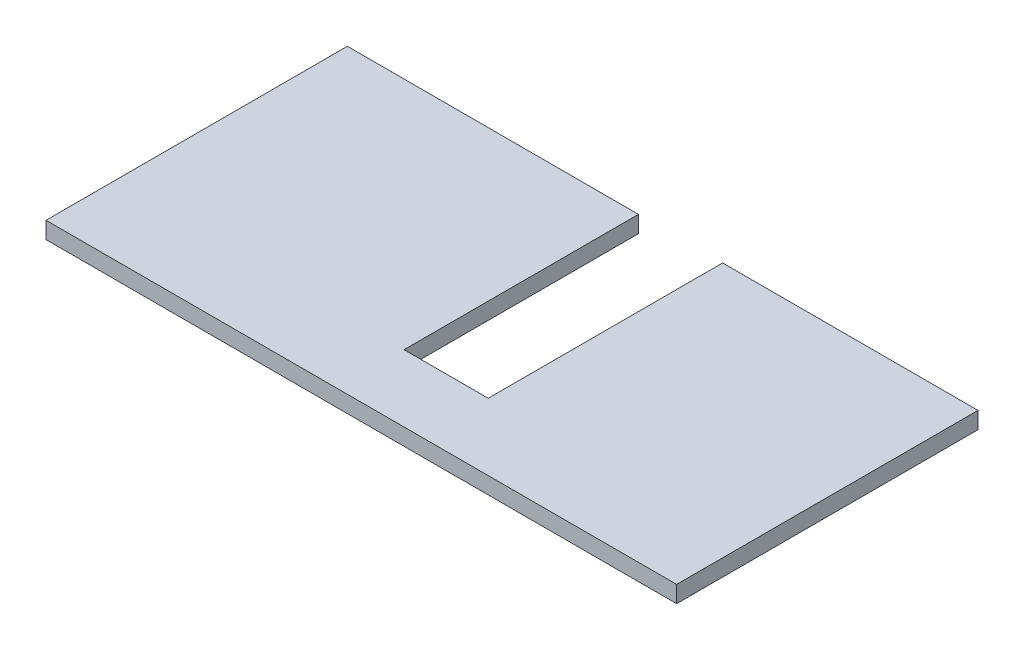
ISO-10303-21;
HEADER;
FILE_DESCRIPTION(('STEP AP214'),'2;1');
FILE_NAME('part.step','',(''),(''),'','','');
FILE_SCHEMA(('AUTOMOTIVE_DESIGN { 1 0 10303 214 1 1 1 1 }'));
ENDSEC;
DATA;
#1=APPLICATION_CONTEXT('core data for automotive mechanical design processes');
#2=APPLICATION_PROTOCOL_DEFINITION('international standard','automotive_design',2000,#1);
#3=PRODUCT_CONTEXT('',#1,'mechanical');
#4=PRODUCT('Part','Part','',(#3));
#5=PRODUCT_RELATED_PRODUCT_CATEGORY('part','',(#4));
#6=PRODUCT_DEFINITION_FORMATION('','',#4);
#7=PRODUCT_DEFINITION_CONTEXT('part definition',#1,'design');
#8=PRODUCT_DEFINITION('design','',#6,#7);
#9=PRODUCT_DEFINITION_SHAPE('','',#8);
#10=(LENGTH_UNIT() NAMED_UNIT(*) SI_UNIT(.MILLI.,.METRE.));
#11=(NAMED_UNIT(*) PLANE_ANGLE_UNIT() SI_UNIT($,.RADIAN.));
#12=(NAMED_UNIT(*) SI_UNIT($,.STERADIAN.) SOLID_ANGLE_UNIT());
#13=UNCERTAINTY_MEASURE_WITH_UNIT(LENGTH_MEASURE(1.E-05),#10,'distance_accuracy_value','');
#14=(GEOMETRIC_REPRESENTATION_CONTEXT(3) GLOBAL_UNCERTAINTY_ASSIGNED_CONTEXT((#13)) GLOBAL_UNIT_ASSIGNED_CONTEXT((#10,
#11,#12)) REPRESENTATION_CONTEXT('',''));
#15=CARTESIAN_POINT('',(0.,0.,0.));
#16=DIRECTION('',(0.,0.,1.));
#17=DIRECTION('',(1.,0.,0.));
#18=AXIS2_PLACEMENT_3D('',#15,#16,#17);
#19=CARTESIAN_POINT('',(0.,0.,0.));
#20=DIRECTION('',(0.,0.,-1.));
#21=DIRECTION('',(-1.,0.,0.));
#22=AXIS2_PLACEMENT_3D('',#19,#20,#21);
#23=PLANE('',#22);
#24=DIRECTION('',(0.,1.,0.));
#25=VECTOR('',#24,1.);
#26=CARTESIAN_POINT('',(3362.,0.,0.));
#27=LINE('',#26,#25);
#28=CARTESIAN_POINT('',(3362.,0.,0.));
#29=VERTEX_POINT('',#28);
#30=CARTESIAN_POINT('',(3362.,150.,0.));
#31=VERTEX_POINT('',#30);
#32=EDGE_CURVE('E113',#29,#31,#27,.T.);
#33=ORIENTED_EDGE('',*,*,#32,.T.);
#34=DIRECTION('',(-1.,0.,0.));
#35=VECTOR('',#34,1.);
#36=CARTESIAN_POINT('',(0.,150.,0.));
#37=LINE('',#36,#35);
#38=CARTESIAN_POINT('',(5650.,150.,0.));
#39=VERTEX_POINT('',#38);
#40=EDGE_CURVE('E151',#39,#31,#37,.T.);
#41=ORIENTED_EDGE('',*,*,#40,.F.);
#42=DIRECTION('',(0.,1.,0.));
#43=VECTOR('',#42,1.);
#44=CARTESIAN_POINT('',(5650.,0.,0.));
#45=LINE('',#44,#43);
#46=CARTESIAN_POINT('',(5650.,0.,0.));
#47=VERTEX_POINT('',#46);
#48=EDGE_CURVE('E136',#47,#39,#45,.T.);
#49=ORIENTED_EDGE('',*,*,#48,.F.);
#50=DIRECTION('',(1.,0.,0.));
#51=VECTOR('',#50,1.);
#52=CARTESIAN_POINT('',(0.,0.,0.));
#53=LINE('',#52,#51);
#54=EDGE_CURVE('E129',#29,#47,#53,.T.);
#55=ORIENTED_EDGE('',*,*,#54,.F.);
#56=EDGE_LOOP('',(#33,#41,#49,#55));
#57=FACE_BOUND('',#56,.T.);
#58=ADVANCED_FACE('F38',(#57),#23,.T.);
#59=CARTESIAN_POINT('',(0.,0.,2700.));
#60=DIRECTION('',(1.,0.,0.));
#61=DIRECTION('',(0.,0.,-1.));
#62=AXIS2_PLACEMENT_3D('',#59,#60,#61);
#63=PLANE('',#62);
#64=DIRECTION('',(0.,-1.,0.));
#65=VECTOR('',#64,1.);
#66=CARTESIAN_POINT('',(0.,0.,0.));
#67=LINE('',#66,#65);
#68=CARTESIAN_POINT('',(0.,150.,0.));
#69=VERTEX_POINT('',#68);
#70=CARTESIAN_POINT('',(0.,0.,0.));
#71=VERTEX_POINT('',#70);
#72=EDGE_CURVE('E139',#69,#71,#67,.T.);
#73=ORIENTED_EDGE('',*,*,#72,.T.);
#74=DIRECTION('',(0.,0.,-1.));
#75=VECTOR('',#74,1.);
#76=CARTESIAN_POINT('',(0.,0.,2700.));
#77=LINE('',#76,#75);
#78=CARTESIAN_POINT('',(0.,0.,2700.));
#79=VERTEX_POINT('',#78);
#80=EDGE_CURVE('E11',#79,#71,#77,.T.);
#81=ORIENTED_EDGE('',*,*,#80,.F.);
#82=DIRECTION('',(0.,-1.,0.));
#83=VECTOR('',#82,1.);
#84=CARTESIAN_POINT('',(0.,0.,2700.));
#85=LINE('',#84,#83);
#86=CARTESIAN_POINT('',(0.,150.,2700.));
#87=VERTEX_POINT('',#86);
#88=EDGE_CURVE('E154',#87,#79,#85,.T.);
#89=ORIENTED_EDGE('',*,*,#88,.F.);
#90=DIRECTION('',(0.,0.,-1.));
#91=VECTOR('',#90,1.);
#92=CARTESIAN_POINT('',(0.,150.,2700.));
#93=LINE('',#92,#91);
#94=EDGE_CURVE('E155',#87,#69,#93,.T.);
#95=ORIENTED_EDGE('',*,*,#94,.T.);
#96=EDGE_LOOP('',(#73,#81,#89,#95));
#97=FACE_BOUND('',#96,.T.);
#98=ADVANCED_FACE('F40',(#97),#63,.F.);
#99=CARTESIAN_POINT('',(0.,0.,2700.));
#100=DIRECTION('',(0.,1.,0.));
#101=DIRECTION('',(0.,0.,1.));
#102=AXIS2_PLACEMENT_3D('',#99,#100,#101);
#103=PLANE('',#102);
#104=DIRECTION('',(1.,0.,0.));
#105=VECTOR('',#104,1.);
#106=CARTESIAN_POINT('',(3362.,0.,2100.));
#107=LINE('',#106,#105);
#108=CARTESIAN_POINT('',(2608.,0.,2100.));
#109=VERTEX_POINT('',#108);
#110=CARTESIAN_POINT('',(3362.,0.,2100.));
#111=VERTEX_POINT('',#110);
#112=EDGE_CURVE('E126',#109,#111,#107,.T.);
#113=ORIENTED_EDGE('',*,*,#112,.T.);
#114=DIRECTION('',(0.,0.,-1.));
#115=VECTOR('',#114,1.);
#116=CARTESIAN_POINT('',(3362.,0.,0.));
#117=LINE('',#116,#115);
#118=EDGE_CURVE('E116',#111,#29,#117,.T.);
#119=ORIENTED_EDGE('',*,*,#118,.T.);
#120=ORIENTED_EDGE('',*,*,#54,.T.);
#121=DIRECTION('',(0.,0.,-1.));
#122=VECTOR('',#121,1.);
#123=CARTESIAN_POINT('',(5650.,0.,2700.));
#124=LINE('',#123,#122);
#125=CARTESIAN_POINT('',(5650.,0.,2700.));
#126=VERTEX_POINT('',#125);
#127=EDGE_CURVE('E47',#126,#47,#124,.T.);
#128=ORIENTED_EDGE('',*,*,#127,.F.);
#129=DIRECTION('',(1.,0.,0.));
#130=VECTOR('',#129,1.);
#131=CARTESIAN_POINT('',(0.,0.,2700.));
#132=LINE('',#131,#130);
#133=EDGE_CURVE('E91',#79,#126,#132,.T.);
#134=ORIENTED_EDGE('',*,*,#133,.F.);
#135=ORIENTED_EDGE('',*,*,#80,.T.);
#136=CARTESIAN_POINT('',(2608.,0.,0.));
#137=VERTEX_POINT('',#136);
#138=EDGE_CURVE('E138',#71,#137,#53,.T.);
#139=ORIENTED_EDGE('',*,*,#138,.T.);
#140=DIRECTION('',(0.,0.,1.));
#141=VECTOR('',#140,1.);
#142=CARTESIAN_POINT('',(2608.,0.,0.));
#143=LINE('',#142,#141);
#144=EDGE_CURVE('E54',#137,#109,#143,.T.);
#145=ORIENTED_EDGE('',*,*,#144,.T.);
#146=EDGE_LOOP('',(#113,#119,#120,#128,#134,#135,#139,#145));
#147=FACE_BOUND('',#146,.T.);
#148=ADVANCED_FACE('F128',(#147),#103,.F.);
#149=CARTESIAN_POINT('',(5650.,0.,2700.));
#150=DIRECTION('',(-1.,0.,0.));
#151=DIRECTION('',(0.,0.,1.));
#152=AXIS2_PLACEMENT_3D('',#149,#150,#151);
#153=PLANE('',#152);
#154=ORIENTED_EDGE('',*,*,#48,.T.);
#155=DIRECTION('',(0.,0.,-1.));
#156=VECTOR('',#155,1.);
#157=CARTESIAN_POINT('',(5650.,150.,2700.));
#158=LINE('',#157,#156);
#159=CARTESIAN_POINT('',(5650.,150.,2700.));
#160=VERTEX_POINT('',#159);
#161=EDGE_CURVE('E158',#160,#39,#158,.T.);
#162=ORIENTED_EDGE('',*,*,#161,.F.);
#163=DIRECTION('',(0.,1.,0.));
#164=VECTOR('',#163,1.);
#165=CARTESIAN_POINT('',(5650.,0.,2700.));
#166=LINE('',#165,#164);
#167=EDGE_CURVE('E166',#126,#160,#166,.T.);
#168=ORIENTED_EDGE('',*,*,#167,.F.);
#169=ORIENTED_EDGE('',*,*,#127,.T.);
#170=EDGE_LOOP('',(#154,#162,#168,#169));
#171=FACE_BOUND('',#170,.T.);
#172=ADVANCED_FACE('F164',(#171),#153,.F.);
#173=CARTESIAN_POINT('',(0.,150.,2700.));
#174=DIRECTION('',(0.,-1.,0.));
#175=DIRECTION('',(1.,0.,0.));
#176=AXIS2_PLACEMENT_3D('',#173,#174,#175);
#177=PLANE('',#176);
#178=ORIENTED_EDGE('',*,*,#40,.T.);
#179=DIRECTION('',(0.,0.,-1.));
#180=VECTOR('',#179,1.);
#181=CARTESIAN_POINT('',(3362.,150.,0.));
#182=LINE('',#181,#180);
#183=CARTESIAN_POINT('',(3362.,150.,2100.));
#184=VERTEX_POINT('',#183);
#185=EDGE_CURVE('E119',#184,#31,#182,.T.);
#186=ORIENTED_EDGE('',*,*,#185,.F.);
#187=DIRECTION('',(1.,0.,0.));
#188=VECTOR('',#187,1.);
#189=CARTESIAN_POINT('',(3362.,150.,2100.));
#190=LINE('',#189,#188);
#191=CARTESIAN_POINT('',(2608.,150.,2100.));
#192=VERTEX_POINT('',#191);
#193=EDGE_CURVE('E133',#192,#184,#190,.T.);
#194=ORIENTED_EDGE('',*,*,#193,.F.);
#195=DIRECTION('',(0.,0.,1.));
#196=VECTOR('',#195,1.);
#197=CARTESIAN_POINT('',(2608.,150.,0.));
#198=LINE('',#197,#196);
#199=CARTESIAN_POINT('',(2608.,150.,0.));
#200=VERTEX_POINT('',#199);
#201=EDGE_CURVE('E185',#200,#192,#198,.T.);
#202=ORIENTED_EDGE('',*,*,#201,.F.);
#203=EDGE_CURVE('E84',#200,#69,#37,.T.);
#204=ORIENTED_EDGE('',*,*,#203,.T.);
#205=ORIENTED_EDGE('',*,*,#94,.F.);
#206=DIRECTION('',(-1.,0.,0.));
#207=VECTOR('',#206,1.);
#208=CARTESIAN_POINT('',(0.,150.,2700.));
#209=LINE('',#208,#207);
#210=EDGE_CURVE('E63',#160,#87,#209,.T.);
#211=ORIENTED_EDGE('',*,*,#210,.F.);
#212=ORIENTED_EDGE('',*,*,#161,.T.);
#213=EDGE_LOOP('',(#178,#186,#194,#202,#204,#205,#211,#212));
#214=FACE_BOUND('',#213,.T.);
#215=ADVANCED_FACE('F200',(#214),#177,.F.);
#216=CARTESIAN_POINT('',(0.,0.,2700.));
#217=DIRECTION('',(0.,0.,-1.));
#218=DIRECTION('',(-1.,0.,0.));
#219=AXIS2_PLACEMENT_3D('',#216,#217,#218);
#220=PLANE('',#219);
#221=ORIENTED_EDGE('',*,*,#88,.T.);
#222=ORIENTED_EDGE('',*,*,#133,.T.);
#223=ORIENTED_EDGE('',*,*,#167,.T.);
#224=ORIENTED_EDGE('',*,*,#210,.T.);
#225=EDGE_LOOP('',(#221,#222,#223,#224));
#226=FACE_BOUND('',#225,.T.);
#227=ADVANCED_FACE('F222',(#226),#220,.F.);
#228=DIRECTION('',(0.,1.,0.));
#229=VECTOR('',#228,1.);
#230=CARTESIAN_POINT('',(2608.,0.,0.));
#231=LINE('',#230,#229);
#232=EDGE_CURVE('E125',#137,#200,#231,.T.);
#233=ORIENTED_EDGE('',*,*,#232,.F.);
#234=ORIENTED_EDGE('',*,*,#138,.F.);
#235=ORIENTED_EDGE('',*,*,#72,.F.);
#236=ORIENTED_EDGE('',*,*,#203,.F.);
#237=EDGE_LOOP('',(#233,#234,#235,#236));
#238=FACE_BOUND('',#237,.T.);
#239=ADVANCED_FACE('F197',(#238),#23,.T.);
#240=CARTESIAN_POINT('',(3362.,0.,0.));
#241=DIRECTION('',(1.,0.,0.));
#242=DIRECTION('',(0.,0.,-1.));
#243=AXIS2_PLACEMENT_3D('',#240,#241,#242);
#244=PLANE('',#243);
#245=ORIENTED_EDGE('',*,*,#185,.T.);
#246=ORIENTED_EDGE('',*,*,#32,.F.);
#247=ORIENTED_EDGE('',*,*,#118,.F.);
#248=DIRECTION('',(0.,1.,0.));
#249=VECTOR('',#248,1.);
#250=CARTESIAN_POINT('',(3362.,0.,2100.));
#251=LINE('',#250,#249);
#252=EDGE_CURVE('E145',#111,#184,#251,.T.);
#253=ORIENTED_EDGE('',*,*,#252,.T.);
#254=EDGE_LOOP('',(#245,#246,#247,#253));
#255=FACE_BOUND('',#254,.T.);
#256=ADVANCED_FACE('F115',(#255),#244,.F.);
#257=CARTESIAN_POINT('',(3362.,0.,2100.));
#258=DIRECTION('',(0.,0.,1.));
#259=DIRECTION('',(1.,0.,0.));
#260=AXIS2_PLACEMENT_3D('',#257,#258,#259);
#261=PLANE('',#260);
#262=ORIENTED_EDGE('',*,*,#193,.T.);
#263=ORIENTED_EDGE('',*,*,#252,.F.);
#264=ORIENTED_EDGE('',*,*,#112,.F.);
#265=DIRECTION('',(0.,1.,0.));
#266=VECTOR('',#265,1.);
#267=CARTESIAN_POINT('',(2608.,0.,2100.));
#268=LINE('',#267,#266);
#269=EDGE_CURVE('E177',#109,#192,#268,.T.);
#270=ORIENTED_EDGE('',*,*,#269,.T.);
#271=EDGE_LOOP('',(#262,#263,#264,#270));
#272=FACE_BOUND('',#271,.T.);
#273=ADVANCED_FACE('F202',(#272),#261,.F.);
#274=CARTESIAN_POINT('',(2608.,0.,0.));
#275=DIRECTION('',(-1.,0.,0.));
#276=DIRECTION('',(0.,0.,1.));
#277=AXIS2_PLACEMENT_3D('',#274,#275,#276);
#278=PLANE('',#277);
#279=ORIENTED_EDGE('',*,*,#201,.T.);
#280=ORIENTED_EDGE('',*,*,#269,.F.);
#281=ORIENTED_EDGE('',*,*,#144,.F.);
#282=ORIENTED_EDGE('',*,*,#232,.T.);
#283=EDGE_LOOP('',(#279,#280,#281,#282));
#284=FACE_BOUND('',#283,.T.);
#285=ADVANCED_FACE('F198',(#284),#278,.F.);
#286=CLOSED_SHELL('',(#58,#98,#148,#172,#215,#227,#239,#256,#273,#285));
#287=MANIFOLD_SOLID_BREP('B2',#286);
#288=ADVANCED_BREP_SHAPE_REPRESENTATION('',(#18,#287),#14);
#289=SHAPE_DEFINITION_REPRESENTATION(#9,#288);
ENDSEC;
END-ISO-10303-21;
